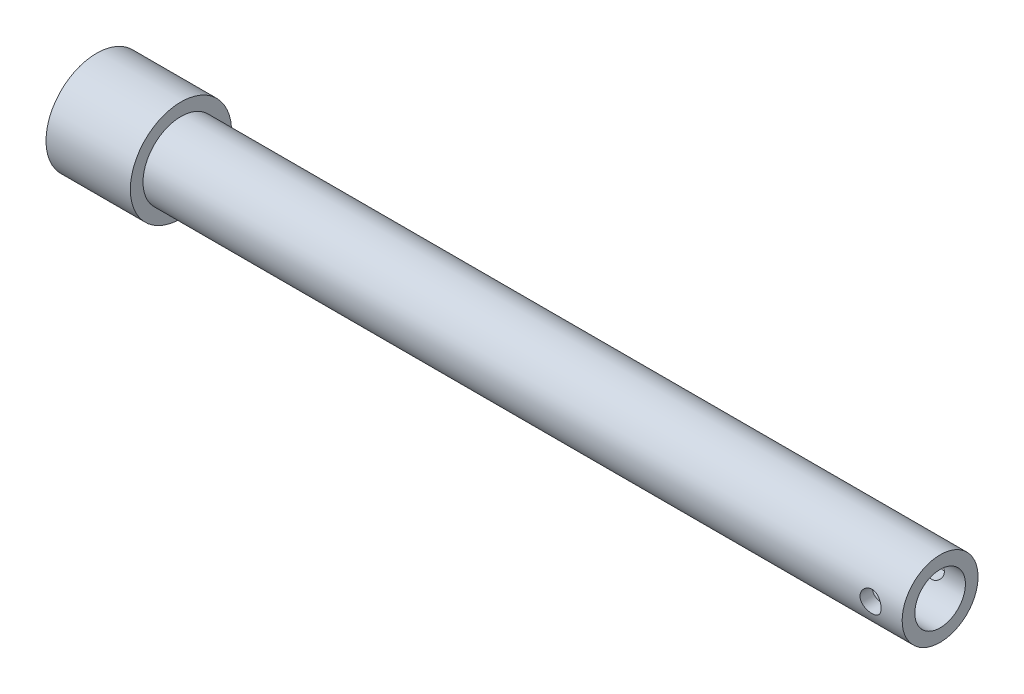
ISO-10303-21;
HEADER;
FILE_DESCRIPTION(('STEP AP214'),'2;1');
FILE_NAME('part.step','',(''),(''),'','','');
FILE_SCHEMA(('AUTOMOTIVE_DESIGN { 1 0 10303 214 1 1 1 1 }'));
ENDSEC;
DATA;
#1=APPLICATION_CONTEXT('core data for automotive mechanical design processes');
#2=APPLICATION_PROTOCOL_DEFINITION('international standard','automotive_design',2000,#1);
#3=PRODUCT_CONTEXT('',#1,'mechanical');
#4=PRODUCT('Part','Part','',(#3));
#5=PRODUCT_RELATED_PRODUCT_CATEGORY('part','',(#4));
#6=PRODUCT_DEFINITION_FORMATION('','',#4);
#7=PRODUCT_DEFINITION_CONTEXT('part definition',#1,'design');
#8=PRODUCT_DEFINITION('design','',#6,#7);
#9=PRODUCT_DEFINITION_SHAPE('','',#8);
#10=(LENGTH_UNIT() NAMED_UNIT(*) SI_UNIT(.MILLI.,.METRE.));
#11=(NAMED_UNIT(*) PLANE_ANGLE_UNIT() SI_UNIT($,.RADIAN.));
#12=(NAMED_UNIT(*) SI_UNIT($,.STERADIAN.) SOLID_ANGLE_UNIT());
#13=UNCERTAINTY_MEASURE_WITH_UNIT(LENGTH_MEASURE(1.E-05),#10,'distance_accuracy_value','');
#14=(GEOMETRIC_REPRESENTATION_CONTEXT(3) GLOBAL_UNCERTAINTY_ASSIGNED_CONTEXT((#13)) GLOBAL_UNIT_ASSIGNED_CONTEXT((#10,
#11,#12)) REPRESENTATION_CONTEXT('',''));
#15=CARTESIAN_POINT('',(0.,0.,0.));
#16=DIRECTION('',(0.,0.,1.));
#17=DIRECTION('',(1.,0.,0.));
#18=AXIS2_PLACEMENT_3D('',#15,#16,#17);
#19=CARTESIAN_POINT('',(0.,0.,0.));
#20=DIRECTION('',(-1.,0.,0.));
#21=DIRECTION('',(0.,0.,1.));
#22=AXIS2_PLACEMENT_3D('',#19,#20,#21);
#23=PLANE('',#22);
#24=CARTESIAN_POINT('',(0.,0.,0.));
#25=DIRECTION('',(-1.,0.,0.));
#26=DIRECTION('',(0.,0.,1.));
#27=AXIS2_PLACEMENT_3D('',#24,#25,#26);
#28=CIRCLE('',#27,12.);
#29=CARTESIAN_POINT('',(0.,0.,12.));
#30=VERTEX_POINT('',#29);
#31=EDGE_CURVE('E10',#30,#30,#28,.T.);
#32=ORIENTED_EDGE('',*,*,#31,.T.);
#33=EDGE_LOOP('',(#32));
#34=FACE_BOUND('',#33,.T.);
#35=ADVANCED_FACE('F35',(#34),#23,.T.);
#36=CARTESIAN_POINT('',(0.,0.,0.));
#37=DIRECTION('',(-1.,0.,0.));
#38=DIRECTION('',(0.,0.,1.));
#39=AXIS2_PLACEMENT_3D('',#36,#37,#38);
#40=CYLINDRICAL_SURFACE('',#39,12.);
#41=CARTESIAN_POINT('',(20.,0.,0.));
#42=DIRECTION('',(-1.,0.,0.));
#43=DIRECTION('',(0.,0.,1.));
#44=AXIS2_PLACEMENT_3D('',#41,#42,#43);
#45=CIRCLE('',#44,12.);
#46=CARTESIAN_POINT('',(20.,0.,12.));
#47=VERTEX_POINT('',#46);
#48=EDGE_CURVE('E47',#47,#47,#45,.T.);
#49=ORIENTED_EDGE('',*,*,#48,.T.);
#50=EDGE_LOOP('',(#49));
#51=FACE_BOUND('',#50,.T.);
#52=ORIENTED_EDGE('',*,*,#31,.F.);
#53=EDGE_LOOP('',(#52));
#54=FACE_BOUND('',#53,.T.);
#55=ADVANCED_FACE('F95',(#51,#54),#40,.T.);
#56=CARTESIAN_POINT('',(20.,-9.,0.));
#57=DIRECTION('',(1.,0.,0.));
#58=DIRECTION('',(0.,0.,-1.));
#59=AXIS2_PLACEMENT_3D('',#56,#57,#58);
#60=PLANE('',#59);
#61=CARTESIAN_POINT('',(20.,0.,0.));
#62=DIRECTION('',(-1.,0.,0.));
#63=DIRECTION('',(0.,0.,1.));
#64=AXIS2_PLACEMENT_3D('',#61,#62,#63);
#65=CIRCLE('',#64,9.);
#66=CARTESIAN_POINT('',(20.,0.,9.));
#67=VERTEX_POINT('',#66);
#68=EDGE_CURVE('E52',#67,#67,#65,.T.);
#69=ORIENTED_EDGE('',*,*,#68,.T.);
#70=EDGE_LOOP('',(#69));
#71=FACE_BOUND('',#70,.T.);
#72=ORIENTED_EDGE('',*,*,#48,.F.);
#73=EDGE_LOOP('',(#72));
#74=FACE_BOUND('',#73,.T.);
#75=ADVANCED_FACE('F91',(#71,#74),#60,.T.);
#76=CARTESIAN_POINT('',(0.,0.,0.));
#77=DIRECTION('',(-1.,0.,0.));
#78=DIRECTION('',(0.,0.,1.));
#79=AXIS2_PLACEMENT_3D('',#76,#77,#78);
#80=CYLINDRICAL_SURFACE('',#79,9.);
#81=CARTESIAN_POINT('',(195.,0.,9.));
#82=CARTESIAN_POINT('',(194.99999720083,0.137602501766361,8.99999816033858));
#83=CARTESIAN_POINT('',(194.988601360389,0.275234247505339,8.99681348173661));
#84=CARTESIAN_POINT('',(194.943408543469,0.546518951988484,8.98441900396477));
#85=CARTESIAN_POINT('',(194.909602116573,0.680170207326886,8.97520666298524));
#86=CARTESIAN_POINT('',(194.820782561172,0.93953989936061,8.95177130789171));
#87=CARTESIAN_POINT('',(194.765798062603,1.06526878019134,8.9375550606186));
#88=CARTESIAN_POINT('',(194.636292987346,1.30572139048356,8.90560625164058));
#89=CARTESIAN_POINT('',(194.561770676161,1.42044414162462,8.88787337777625));
#90=CARTESIAN_POINT('',(194.393341132314,1.63849356943186,8.85030315634724));
#91=CARTESIAN_POINT('',(194.299035920625,1.74150622561692,8.8304274724643));
#92=CARTESIAN_POINT('',(194.094567445757,1.93047637139274,8.79105214235472));
#93=CARTESIAN_POINT('',(193.984401955448,2.01643146169126,8.77155254937624));
#94=CARTESIAN_POINT('',(193.748785479743,2.17041617160632,8.73474088585436));
#95=CARTESIAN_POINT('',(193.623085583117,2.23807749895615,8.71747695878199));
#96=CARTESIAN_POINT('',(193.361536164715,2.35117914262343,8.68765801630373));
#97=CARTESIAN_POINT('',(193.225688699167,2.39662394672716,8.67510204999899));
#98=CARTESIAN_POINT('',(192.951194422294,2.46289848736027,8.65651766235507));
#99=CARTESIAN_POINT('',(192.812696356753,2.48430073808208,8.6503377182121));
#100=CARTESIAN_POINT('',(192.533948228915,2.50366854155518,8.644752985852));
#101=CARTESIAN_POINT('',(192.393698530255,2.50163888054629,8.64534681401298));
#102=CARTESIAN_POINT('',(192.119955442552,2.47465342675363,8.65310733650122));
#103=CARTESIAN_POINT('',(191.986386397007,2.45039804541377,8.66007321349827));
#104=CARTESIAN_POINT('',(191.725292742818,2.38077462403781,8.67947034094292));
#105=CARTESIAN_POINT('',(191.597768654796,2.33540476914309,8.69190206119269));
#106=CARTESIAN_POINT('',(191.350595537089,2.22428746268941,8.72100139554956));
#107=CARTESIAN_POINT('',(191.23106026638,2.15830043673987,8.7377183720132));
#108=CARTESIAN_POINT('',(191.004516848818,2.0079888135927,8.77347901367673));
#109=CARTESIAN_POINT('',(190.897511362548,1.92366033258121,8.79252317128379));
#110=CARTESIAN_POINT('',(190.695072239127,1.73551122056889,8.83162144253916));
#111=CARTESIAN_POINT('',(190.60018473024,1.63110455940471,8.85168740075652));
#112=CARTESIAN_POINT('',(190.429148538444,1.40761321440207,8.88996399621587));
#113=CARTESIAN_POINT('',(190.353000723795,1.28852785084393,8.90817454746904));
#114=CARTESIAN_POINT('',(190.22133636874,1.03816685867624,8.9408167942553));
#115=CARTESIAN_POINT('',(190.165925792122,0.906832791495497,8.95522897291068));
#116=CARTESIAN_POINT('',(190.078131803117,0.636219977539428,8.97850985002888));
#117=CARTESIAN_POINT('',(190.045742915687,0.49694312824226,8.98737986647399));
#118=CARTESIAN_POINT('',(190.005785726442,0.219053215426282,8.99837472966817));
#119=CARTESIAN_POINT('',(189.997475710186,0.080554611717358,9.00070107648057));
#120=CARTESIAN_POINT('',(190.003853996585,-0.195859861273143,8.99892960586323));
#121=CARTESIAN_POINT('',(190.018539703296,-0.333775794569047,8.9948325135635));
#122=CARTESIAN_POINT('',(190.069886668239,-0.602413826941726,8.98080530118043));
#123=CARTESIAN_POINT('',(190.106127890115,-0.733222576327732,8.97098674335107));
#124=CARTESIAN_POINT('',(190.199063735276,-0.986886236237465,8.94663658338763));
#125=CARTESIAN_POINT('',(190.255760665139,-1.10974024794482,8.93210444977129));
#126=CARTESIAN_POINT('',(190.389331756093,-1.34684028081079,8.89947480568143));
#127=CARTESIAN_POINT('',(190.466601048645,-1.46085412390692,8.88130942680351));
#128=CARTESIAN_POINT('',(190.638632271615,-1.6745553411742,8.84350954257204));
#129=CARTESIAN_POINT('',(190.733397960133,-1.77423962926345,8.82387472213289));
#130=CARTESIAN_POINT('',(190.941202887755,-1.95962405388923,8.78459685365757));
#131=CARTESIAN_POINT('',(191.054714903108,-2.04479915770504,8.76497216404559));
#132=CARTESIAN_POINT('',(191.294841275767,-2.19491162858283,8.72859386619893));
#133=CARTESIAN_POINT('',(191.421455131712,-2.25984976965916,8.71184014816765));
#134=CARTESIAN_POINT('',(191.683614339749,-2.36716211667705,8.68329597870045));
#135=CARTESIAN_POINT('',(191.819105275428,-2.40966154966514,8.67147806034821));
#136=CARTESIAN_POINT('',(192.095699418744,-2.47115304987675,8.65415753646738));
#137=CARTESIAN_POINT('',(192.236801029232,-2.49015175812554,8.64865314684266));
#138=CARTESIAN_POINT('',(192.515211559014,-2.50369719949212,8.64474076665062));
#139=CARTESIAN_POINT('',(192.652476380069,-2.49909142028601,8.64608680814104));
#140=CARTESIAN_POINT('',(192.924189787621,-2.46754286573622,8.65514273976249));
#141=CARTESIAN_POINT('',(193.058638458541,-2.44060076098733,8.66285243883987));
#142=CARTESIAN_POINT('',(193.319734467823,-2.3656544849756,8.68361437649822));
#143=CARTESIAN_POINT('',(193.446441685292,-2.31784429282324,8.69661733835621));
#144=CARTESIAN_POINT('',(193.690134845018,-2.20266903341382,8.72649832095034));
#145=CARTESIAN_POINT('',(193.807119142972,-2.13530066717354,8.74337699532341));
#146=CARTESIAN_POINT('',(194.032055305649,-1.98041392404221,8.77977621573303));
#147=CARTESIAN_POINT('',(194.139602953365,-1.89232416869261,8.79936357965206));
#148=CARTESIAN_POINT('',(194.338664744107,-1.69956305490126,8.83861663818042));
#149=CARTESIAN_POINT('',(194.430174905782,-1.59488759125637,8.85828235100436));
#150=CARTESIAN_POINT('',(194.596716273156,-1.36892046461579,8.89603679163285));
#151=CARTESIAN_POINT('',(194.671303246621,-1.24729251786436,8.91407682385634));
#152=CARTESIAN_POINT('',(194.798856278579,-0.992723965385682,8.94599949801159));
#153=CARTESIAN_POINT('',(194.851835037162,-0.859790060353452,8.95988458070659));
#154=CARTESIAN_POINT('',(194.928440161469,-0.606290967533404,8.98032149663911));
#155=CARTESIAN_POINT('',(194.955209575186,-0.486728804337484,8.98764491323713));
#156=CARTESIAN_POINT('',(194.990989691645,-0.244785251386819,8.99748469952567));
#157=CARTESIAN_POINT('',(195.00000249,-0.122404196038831,9.00000163646935));
#158=CARTESIAN_POINT('',(195.,0.,9.));
#159=B_SPLINE_CURVE_WITH_KNOTS('',3,(#81,#82,#83,#84,#85,#86,#87,#88,#89,#90,#91,#92,#93,#94,
#95,#96,#97,#98,#99,#100,#101,#102,#103,#104,#105,#106,#107,#108,#109,#110,#111,#112,#113,#114,
#115,#116,#117,#118,#119,#120,#121,#122,#123,#124,#125,#126,#127,#128,#129,#130,#131,#132,#133,
#134,#135,#136,#137,#138,#139,#140,#141,#142,#143,#144,#145,#146,#147,#148,#149,#150,#151,#152,
#153,#154,#155,#156,#157,#158),.UNSPECIFIED.,.T.,.F.,(4,2,2,2,2,2,2,2,2,2,2,2,2,2,2,2,2,2,2,2,2,
2,2,2,2,2,2,2,2,2,2,2,2,2,2,2,2,2,4),(0.,0.412358386198989,0.824890772294532,1.23686741588571,
1.64888064567588,2.0701524865053,2.49148354087993,2.92075380647346,3.34993732266769,
3.76866863882698,4.18731442577049,4.59320465989603,4.99912978807066,5.40995920090073,
5.82087569194114,6.24638987685089,6.67192377325056,7.09960331280663,7.52718110708778,
7.94144021185618,8.3556525550572,8.76204634963737,9.16848598334843,9.58337897777218,
9.99836119210695,10.4261198341447,10.8538621134517,11.2791912971971,11.7044002604959,
12.1144519850641,12.5244913992551,12.9307978713246,13.3371729171667,13.7564382656795,
14.1758075510165,14.6051618118988,15.0342633576385,15.4011197307047,15.7679328052828),.UNSPECIFIED.);
#160=CARTESIAN_POINT('',(195.,0.,9.));
#161=VERTEX_POINT('',#160);
#162=EDGE_CURVE('E81',#161,#161,#159,.T.);
#163=ORIENTED_EDGE('',*,*,#162,.F.);
#164=EDGE_LOOP('',(#163));
#165=FACE_BOUND('',#164,.T.);
#166=CARTESIAN_POINT('',(195.,0.,-9.));
#167=CARTESIAN_POINT('',(194.99999720083,-0.137602501766361,-8.99999816033858));
#168=CARTESIAN_POINT('',(194.988601360389,-0.275234247505339,-8.99681348173661));
#169=CARTESIAN_POINT('',(194.943408543469,-0.546518951988484,-8.98441900396477));
#170=CARTESIAN_POINT('',(194.909602116573,-0.680170207326886,-8.97520666298524));
#171=CARTESIAN_POINT('',(194.820782561172,-0.93953989936061,-8.95177130789171));
#172=CARTESIAN_POINT('',(194.765798062603,-1.06526878019134,-8.9375550606186));
#173=CARTESIAN_POINT('',(194.636292987346,-1.30572139048356,-8.90560625164058));
#174=CARTESIAN_POINT('',(194.561770676161,-1.42044414162462,-8.88787337777625));
#175=CARTESIAN_POINT('',(194.393341132314,-1.63849356943186,-8.85030315634724));
#176=CARTESIAN_POINT('',(194.299035920625,-1.74150622561692,-8.8304274724643));
#177=CARTESIAN_POINT('',(194.094567445757,-1.93047637139274,-8.79105214235472));
#178=CARTESIAN_POINT('',(193.984401955448,-2.01643146169126,-8.77155254937624));
#179=CARTESIAN_POINT('',(193.748785479743,-2.17041617160632,-8.73474088585436));
#180=CARTESIAN_POINT('',(193.623085583117,-2.23807749895615,-8.71747695878199));
#181=CARTESIAN_POINT('',(193.361536164715,-2.35117914262343,-8.68765801630373));
#182=CARTESIAN_POINT('',(193.225688699167,-2.39662394672716,-8.67510204999899));
#183=CARTESIAN_POINT('',(192.951194422294,-2.46289848736027,-8.65651766235507));
#184=CARTESIAN_POINT('',(192.812696356753,-2.48430073808208,-8.6503377182121));
#185=CARTESIAN_POINT('',(192.533948228915,-2.50366854155518,-8.644752985852));
#186=CARTESIAN_POINT('',(192.393698530255,-2.50163888054629,-8.64534681401298));
#187=CARTESIAN_POINT('',(192.119955442552,-2.47465342675363,-8.65310733650122));
#188=CARTESIAN_POINT('',(191.986386397007,-2.45039804541377,-8.66007321349827));
#189=CARTESIAN_POINT('',(191.725292742818,-2.38077462403781,-8.67947034094292));
#190=CARTESIAN_POINT('',(191.597768654796,-2.33540476914309,-8.69190206119269));
#191=CARTESIAN_POINT('',(191.350595537089,-2.22428746268941,-8.72100139554956));
#192=CARTESIAN_POINT('',(191.23106026638,-2.15830043673987,-8.7377183720132));
#193=CARTESIAN_POINT('',(191.004516848818,-2.0079888135927,-8.77347901367673));
#194=CARTESIAN_POINT('',(190.897511362548,-1.92366033258121,-8.79252317128379));
#195=CARTESIAN_POINT('',(190.695072239127,-1.73551122056889,-8.83162144253916));
#196=CARTESIAN_POINT('',(190.60018473024,-1.63110455940471,-8.85168740075652));
#197=CARTESIAN_POINT('',(190.429148538444,-1.40761321440207,-8.88996399621587));
#198=CARTESIAN_POINT('',(190.353000723795,-1.28852785084393,-8.90817454746904));
#199=CARTESIAN_POINT('',(190.22133636874,-1.03816685867624,-8.9408167942553));
#200=CARTESIAN_POINT('',(190.165925792122,-0.906832791495497,-8.95522897291068));
#201=CARTESIAN_POINT('',(190.078131803117,-0.636219977539428,-8.97850985002888));
#202=CARTESIAN_POINT('',(190.045742915687,-0.49694312824226,-8.98737986647399));
#203=CARTESIAN_POINT('',(190.005785726442,-0.219053215426282,-8.99837472966817));
#204=CARTESIAN_POINT('',(189.997475710186,-0.080554611717358,-9.00070107648057));
#205=CARTESIAN_POINT('',(190.003853996585,0.195859861273143,-8.99892960586323));
#206=CARTESIAN_POINT('',(190.018539703296,0.333775794569047,-8.9948325135635));
#207=CARTESIAN_POINT('',(190.069886668239,0.602413826941726,-8.98080530118043));
#208=CARTESIAN_POINT('',(190.106127890115,0.733222576327732,-8.97098674335107));
#209=CARTESIAN_POINT('',(190.199063735276,0.986886236237465,-8.94663658338763));
#210=CARTESIAN_POINT('',(190.255760665139,1.10974024794482,-8.93210444977129));
#211=CARTESIAN_POINT('',(190.389331756093,1.34684028081079,-8.89947480568143));
#212=CARTESIAN_POINT('',(190.466601048645,1.46085412390692,-8.88130942680351));
#213=CARTESIAN_POINT('',(190.638632271615,1.6745553411742,-8.84350954257204));
#214=CARTESIAN_POINT('',(190.733397960133,1.77423962926345,-8.82387472213289));
#215=CARTESIAN_POINT('',(190.941202887755,1.95962405388923,-8.78459685365757));
#216=CARTESIAN_POINT('',(191.054714903108,2.04479915770504,-8.76497216404559));
#217=CARTESIAN_POINT('',(191.294841275767,2.19491162858283,-8.72859386619893));
#218=CARTESIAN_POINT('',(191.421455131712,2.25984976965916,-8.71184014816765));
#219=CARTESIAN_POINT('',(191.683614339749,2.36716211667705,-8.68329597870045));
#220=CARTESIAN_POINT('',(191.819105275428,2.40966154966514,-8.67147806034821));
#221=CARTESIAN_POINT('',(192.095699418744,2.47115304987675,-8.65415753646738));
#222=CARTESIAN_POINT('',(192.236801029232,2.49015175812554,-8.64865314684266));
#223=CARTESIAN_POINT('',(192.515211559014,2.50369719949212,-8.64474076665062));
#224=CARTESIAN_POINT('',(192.652476380069,2.49909142028601,-8.64608680814104));
#225=CARTESIAN_POINT('',(192.924189787621,2.46754286573622,-8.65514273976249));
#226=CARTESIAN_POINT('',(193.058638458541,2.44060076098733,-8.66285243883987));
#227=CARTESIAN_POINT('',(193.319734467823,2.3656544849756,-8.68361437649822));
#228=CARTESIAN_POINT('',(193.446441685292,2.31784429282324,-8.69661733835621));
#229=CARTESIAN_POINT('',(193.690134845018,2.20266903341382,-8.72649832095034));
#230=CARTESIAN_POINT('',(193.807119142972,2.13530066717354,-8.74337699532341));
#231=CARTESIAN_POINT('',(194.032055305649,1.98041392404221,-8.77977621573303));
#232=CARTESIAN_POINT('',(194.139602953365,1.89232416869261,-8.79936357965206));
#233=CARTESIAN_POINT('',(194.338664744107,1.69956305490126,-8.83861663818042));
#234=CARTESIAN_POINT('',(194.430174905782,1.59488759125637,-8.85828235100436));
#235=CARTESIAN_POINT('',(194.596716273156,1.36892046461579,-8.89603679163285));
#236=CARTESIAN_POINT('',(194.671303246621,1.24729251786436,-8.91407682385634));
#237=CARTESIAN_POINT('',(194.798856278579,0.992723965385682,-8.94599949801159));
#238=CARTESIAN_POINT('',(194.851835037162,0.859790060353452,-8.95988458070659));
#239=CARTESIAN_POINT('',(194.928440161469,0.606290967533404,-8.98032149663911));
#240=CARTESIAN_POINT('',(194.955209575186,0.486728804337484,-8.98764491323713));
#241=CARTESIAN_POINT('',(194.990989691645,0.244785251386819,-8.99748469952567));
#242=CARTESIAN_POINT('',(195.00000249,0.122404196038831,-9.00000163646935));
#243=CARTESIAN_POINT('',(195.,0.,-9.));
#244=B_SPLINE_CURVE_WITH_KNOTS('',3,(#166,#167,#168,#169,#170,#171,#172,#173,#174,#175,#176,
#177,#178,#179,#180,#181,#182,#183,#184,#185,#186,#187,#188,#189,#190,#191,#192,#193,#194,#195,
#196,#197,#198,#199,#200,#201,#202,#203,#204,#205,#206,#207,#208,#209,#210,#211,#212,#213,#214,
#215,#216,#217,#218,#219,#220,#221,#222,#223,#224,#225,#226,#227,#228,#229,#230,#231,#232,#233,
#234,#235,#236,#237,#238,#239,#240,#241,#242,#243),.UNSPECIFIED.,.T.,.F.,(4,2,2,2,2,2,2,2,2,2,2,
2,2,2,2,2,2,2,2,2,2,2,2,2,2,2,2,2,2,2,2,2,2,2,2,2,2,2,4),(0.,0.412358386198989,
0.824890772294532,1.23686741588571,1.64888064567588,2.0701524865053,2.49148354087993,
2.92075380647346,3.34993732266769,3.76866863882698,4.18731442577049,4.59320465989603,
4.99912978807066,5.40995920090073,5.82087569194114,6.24638987685089,6.67192377325056,
7.09960331280663,7.52718110708778,7.94144021185618,8.3556525550572,8.76204634963737,
9.16848598334843,9.58337897777218,9.99836119210695,10.4261198341447,10.8538621134517,
11.2791912971971,11.7044002604959,12.1144519850641,12.5244913992551,12.9307978713246,
13.3371729171667,13.7564382656795,14.1758075510165,14.6051618118988,15.0342633576385,
15.4011197307047,15.7679328052828),.UNSPECIFIED.);
#245=CARTESIAN_POINT('',(195.,0.,-9.));
#246=VERTEX_POINT('',#245);
#247=EDGE_CURVE('E75',#246,#246,#244,.T.);
#248=ORIENTED_EDGE('',*,*,#247,.F.);
#249=EDGE_LOOP('',(#248));
#250=FACE_BOUND('',#249,.T.);
#251=CARTESIAN_POINT('',(200.,0.,0.));
#252=DIRECTION('',(-1.,0.,0.));
#253=DIRECTION('',(0.,0.,1.));
#254=AXIS2_PLACEMENT_3D('',#251,#252,#253);
#255=CIRCLE('',#254,9.);
#256=CARTESIAN_POINT('',(200.,0.,9.));
#257=VERTEX_POINT('',#256);
#258=EDGE_CURVE('E198',#257,#257,#255,.T.);
#259=ORIENTED_EDGE('',*,*,#258,.T.);
#260=EDGE_LOOP('',(#259));
#261=FACE_BOUND('',#260,.T.);
#262=ORIENTED_EDGE('',*,*,#68,.F.);
#263=EDGE_LOOP('',(#262));
#264=FACE_BOUND('',#263,.T.);
#265=ADVANCED_FACE('F86',(#165,#250,#261,#264),#80,.T.);
#266=CARTESIAN_POINT('',(200.,-6.,0.));
#267=DIRECTION('',(1.,0.,0.));
#268=DIRECTION('',(0.,0.,-1.));
#269=AXIS2_PLACEMENT_3D('',#266,#267,#268);
#270=PLANE('',#269);
#271=CARTESIAN_POINT('',(200.,0.,0.));
#272=DIRECTION('',(-1.,0.,0.));
#273=DIRECTION('',(0.,0.,1.));
#274=AXIS2_PLACEMENT_3D('',#271,#272,#273);
#275=CIRCLE('',#274,6.);
#276=CARTESIAN_POINT('',(200.,0.,6.));
#277=VERTEX_POINT('',#276);
#278=EDGE_CURVE('E197',#277,#277,#275,.T.);
#279=ORIENTED_EDGE('',*,*,#278,.T.);
#280=EDGE_LOOP('',(#279));
#281=FACE_BOUND('',#280,.T.);
#282=ORIENTED_EDGE('',*,*,#258,.F.);
#283=EDGE_LOOP('',(#282));
#284=FACE_BOUND('',#283,.T.);
#285=ADVANCED_FACE('F90',(#281,#284),#270,.T.);
#286=CARTESIAN_POINT('',(0.,0.,0.));
#287=DIRECTION('',(-1.,0.,0.));
#288=DIRECTION('',(0.,0.,1.));
#289=AXIS2_PLACEMENT_3D('',#286,#287,#288);
#290=CYLINDRICAL_SURFACE('',#289,6.);
#291=CARTESIAN_POINT('',(195.,0.,6.));
#292=CARTESIAN_POINT('',(194.99999528786,-0.133903918163791,5.99999628290907));
#293=CARTESIAN_POINT('',(194.989178684399,-0.268039524991424,5.99546656821164));
#294=CARTESIAN_POINT('',(194.946319261906,-0.532498019991117,5.97780115788617));
#295=CARTESIAN_POINT('',(194.914221053219,-0.662810029808678,5.96464300599791));
#296=CARTESIAN_POINT('',(194.830178511941,-0.915376593299238,5.93112629106012));
#297=CARTESIAN_POINT('',(194.778301407677,-1.03765681434385,5.91079213642029));
#298=CARTESIAN_POINT('',(194.656454166978,-1.27165974779734,5.8649055925345));
#299=CARTESIAN_POINT('',(194.586489511025,-1.38338564416288,5.83935478441347));
#300=CARTESIAN_POINT('',(194.426742088192,-1.598896740046,5.78415660619863));
#301=CARTESIAN_POINT('',(194.336197396748,-1.70208251703045,5.75437507703432));
#302=CARTESIAN_POINT('',(194.1394713161,-1.89231966019713,5.69465427085227));
#303=CARTESIAN_POINT('',(194.033281746285,-1.97936253123993,5.66471491925557));
#304=CARTESIAN_POINT('',(193.801946448989,-2.13907474876485,5.60642043928223));
#305=CARTESIAN_POINT('',(193.676125104249,-2.21082616169412,5.57821573827598));
#306=CARTESIAN_POINT('',(193.412853483057,-2.33187881316102,5.52871144633222));
#307=CARTESIAN_POINT('',(193.275409240743,-2.38119161708801,5.507408299805));
#308=CARTESIAN_POINT('',(192.999692616738,-2.45349196589848,5.47557110795536));
#309=CARTESIAN_POINT('',(192.861779033289,-2.47763315746004,5.4645677530895));
#310=CARTESIAN_POINT('',(192.583453414554,-2.502504199448,5.45322652433632));
#311=CARTESIAN_POINT('',(192.44304279993,-2.50324696111172,5.45288276849132));
#312=CARTESIAN_POINT('',(192.175199879148,-2.48216900725157,5.46250239122984));
#313=CARTESIAN_POINT('',(192.047597806876,-2.46207362224016,5.47167765447588));
#314=CARTESIAN_POINT('',(191.797775817995,-2.40278382032144,5.49796965547248));
#315=CARTESIAN_POINT('',(191.675556937015,-2.36358574574515,5.51508791407033));
#316=CARTESIAN_POINT('',(191.436884594018,-2.26643917454982,5.55572369545607));
#317=CARTESIAN_POINT('',(191.320609158174,-2.20810943078431,5.57936963898297));
#318=CARTESIAN_POINT('',(191.099044532239,-2.0746248516117,5.63036662282146));
#319=CARTESIAN_POINT('',(190.993759698773,-1.99946338103923,5.65771912259551));
#320=CARTESIAN_POINT('',(190.787800082534,-1.82699193108755,5.71585953755966));
#321=CARTESIAN_POINT('',(190.688266865229,-1.72834696641503,5.74674242808947));
#322=CARTESIAN_POINT('',(190.506772994082,-1.51545918210308,5.80651346225056));
#323=CARTESIAN_POINT('',(190.424816456616,-1.40121271889694,5.83540113754019));
#324=CARTESIAN_POINT('',(190.279128352767,-1.15689589738676,5.88876567112946));
#325=CARTESIAN_POINT('',(190.215861109699,-1.02652116489537,5.91312533086667));
#326=CARTESIAN_POINT('',(190.112557720793,-0.755704805053668,5.95378962829607));
#327=CARTESIAN_POINT('',(190.072508736112,-0.615268789590071,5.970098716916));
#328=CARTESIAN_POINT('',(190.019168015747,-0.337856226692455,5.9919928237277));
#329=CARTESIAN_POINT('',(190.004344285112,-0.201222570557278,5.9981908209425));
#330=CARTESIAN_POINT('',(189.997307552772,0.0727093109921759,6.00112100737489));
#331=CARTESIAN_POINT('',(190.005088059496,0.210007334305267,5.99785591423878));
#332=CARTESIAN_POINT('',(190.041942169612,0.474196484682869,5.9826243531388));
#333=CARTESIAN_POINT('',(190.069939908194,0.601265933278775,5.97109774567979));
#334=CARTESIAN_POINT('',(190.144936389082,0.848765497942182,5.94097213544829));
#335=CARTESIAN_POINT('',(190.191937531901,0.969194773036717,5.92237223919408));
#336=CARTESIAN_POINT('',(190.305141951424,1.20421799973828,5.87916541290331));
#337=CARTESIAN_POINT('',(190.371896366292,1.31851447371068,5.85438982938561));
#338=CARTESIAN_POINT('',(190.522106755583,1.53469243246282,5.80147609158182));
#339=CARTESIAN_POINT('',(190.605569703059,1.63656870520375,5.77333653537473));
#340=CARTESIAN_POINT('',(190.793806466545,1.83266686054868,5.71424175790867));
#341=CARTESIAN_POINT('',(190.899677005972,1.92582139596024,5.68322903182028));
#342=CARTESIAN_POINT('',(191.126042551871,2.09333969221048,5.62368673536039));
#343=CARTESIAN_POINT('',(191.246540870345,2.16769918571028,5.59515772986987));
#344=CARTESIAN_POINT('',(191.501228350604,2.29631920417611,5.54362772487864));
#345=CARTESIAN_POINT('',(191.635588071024,2.35027836475452,5.52071125109802));
#346=CARTESIAN_POINT('',(191.912741187626,2.43434827902355,5.48416711318334));
#347=CARTESIAN_POINT('',(192.055527524989,2.46447869724419,5.47053179113072));
#348=CARTESIAN_POINT('',(192.333637398378,2.49808160700534,5.45526329073079));
#349=CARTESIAN_POINT('',(192.468689324512,2.50342760836087,5.45278701929112));
#350=CARTESIAN_POINT('',(192.737685722355,2.49231151038003,5.45787706027258));
#351=CARTESIAN_POINT('',(192.8716303609,2.47585275892882,5.46544183100006));
#352=CARTESIAN_POINT('',(193.128185494678,2.42316809595847,5.48899102586043));
#353=CARTESIAN_POINT('',(193.251033345978,2.38789807270205,5.50456709625452));
#354=CARTESIAN_POINT('',(193.489096043664,2.29952656276965,5.54206362465904));
#355=CARTESIAN_POINT('',(193.604308734336,2.2464200656009,5.56398586515028));
#356=CARTESIAN_POINT('',(193.831391788147,2.12020572373922,5.61333908853253));
#357=CARTESIAN_POINT('',(193.942644645948,2.04608723750139,5.64102204404078));
#358=CARTESIAN_POINT('',(194.151720293115,1.88136812596242,5.69807379131313));
#359=CARTESIAN_POINT('',(194.249538405032,1.79076178563718,5.72744316520043));
#360=CARTESIAN_POINT('',(194.436297305618,1.5878041689884,5.78712781593092));
#361=CARTESIAN_POINT('',(194.524072642828,1.47434977868816,5.81735619175009));
#362=CARTESIAN_POINT('',(194.679399130042,1.23319985958045,5.87320303099821));
#363=CARTESIAN_POINT('',(194.746941063997,1.10549787741692,5.89881939160172));
#364=CARTESIAN_POINT('',(194.858418870452,0.84146521342221,5.94218308378895));
#365=CARTESIAN_POINT('',(194.90272649429,0.705312056415883,5.96005349044659));
#366=CARTESIAN_POINT('',(194.96741568753,0.426816782070279,5.9864223497589));
#367=CARTESIAN_POINT('',(194.987872168206,0.284495506121995,5.99495014042422));
#368=CARTESIAN_POINT('',(194.997323841786,0.118052512349441,5.99888566614292));
#369=CARTESIAN_POINT('',(194.998326602503,0.0944569348794064,5.99930292614998));
#370=CARTESIAN_POINT('',(194.999665098257,0.0472433090693387,5.99986042138656));
#371=CARTESIAN_POINT('',(195.000000831384,0.0236252606651517,6.0000006558228));
#372=CARTESIAN_POINT('',(195.,0.,6.));
#373=B_SPLINE_CURVE_WITH_KNOTS('',3,(#291,#292,#293,#294,#295,#296,#297,#298,#299,#300,#301,
#302,#303,#304,#305,#306,#307,#308,#309,#310,#311,#312,#313,#314,#315,#316,#317,#318,#319,#320,
#321,#322,#323,#324,#325,#326,#327,#328,#329,#330,#331,#332,#333,#334,#335,#336,#337,#338,#339,
#340,#341,#342,#343,#344,#345,#346,#347,#348,#349,#350,#351,#352,#353,#354,#355,#356,#357,#358,
#359,#360,#361,#362,#363,#364,#365,#366,#367,#368,#369,#370,#371,#372),.UNSPECIFIED.,.T.,.F.,(4,
2,2,2,2,2,2,2,2,2,2,2,2,2,2,2,2,2,2,2,2,2,2,2,2,2,2,2,2,2,2,2,2,2,2,2,2,2,2,2,4),(0.,
0.40161383776788,0.804277081257399,1.20558370381263,1.60676887370596,2.02635872577619,
2.44616876262935,2.8866344907825,3.32687293461179,3.74590546275119,4.16470676498097,
4.55140314405117,4.93817359454431,5.33317426117434,5.7283309143442,6.15688282255799,
6.58553498629183,7.02408110121635,7.46238448436603,7.87296886786511,8.28343534986352,
8.67353179471452,9.06367753203579,9.4659427054433,9.86837610939002,10.299569760586,
10.7308612248069,11.1682957671906,11.6053689414917,12.008797551193,12.4121642259509,
12.7967529992954,13.1814498990124,13.589277867949,13.997247468519,14.4349307000979,
14.8728129885718,15.3034571163879,15.7327450093866,15.8036033125923,15.8744618187071),.UNSPECIFIED.);
#374=CARTESIAN_POINT('',(195.,0.,6.));
#375=VERTEX_POINT('',#374);
#376=EDGE_CURVE('E38',#375,#375,#373,.T.);
#377=ORIENTED_EDGE('',*,*,#376,.F.);
#378=EDGE_LOOP('',(#377));
#379=FACE_BOUND('',#378,.T.);
#380=CARTESIAN_POINT('',(195.,0.,-6.));
#381=CARTESIAN_POINT('',(194.99999528786,0.133903918163791,-5.99999628290907));
#382=CARTESIAN_POINT('',(194.989178684399,0.268039524991424,-5.99546656821164));
#383=CARTESIAN_POINT('',(194.946319261906,0.532498019991117,-5.97780115788617));
#384=CARTESIAN_POINT('',(194.914221053219,0.662810029808678,-5.96464300599791));
#385=CARTESIAN_POINT('',(194.830178511941,0.915376593299238,-5.93112629106012));
#386=CARTESIAN_POINT('',(194.778301407677,1.03765681434385,-5.91079213642029));
#387=CARTESIAN_POINT('',(194.656454166978,1.27165974779734,-5.8649055925345));
#388=CARTESIAN_POINT('',(194.586489511025,1.38338564416288,-5.83935478441347));
#389=CARTESIAN_POINT('',(194.426742088192,1.598896740046,-5.78415660619863));
#390=CARTESIAN_POINT('',(194.336197396748,1.70208251703045,-5.75437507703432));
#391=CARTESIAN_POINT('',(194.1394713161,1.89231966019713,-5.69465427085227));
#392=CARTESIAN_POINT('',(194.033281746285,1.97936253123993,-5.66471491925557));
#393=CARTESIAN_POINT('',(193.801946448989,2.13907474876485,-5.60642043928223));
#394=CARTESIAN_POINT('',(193.676125104249,2.21082616169412,-5.57821573827598));
#395=CARTESIAN_POINT('',(193.412853483057,2.33187881316102,-5.52871144633222));
#396=CARTESIAN_POINT('',(193.275409240743,2.38119161708801,-5.507408299805));
#397=CARTESIAN_POINT('',(192.999692616738,2.45349196589848,-5.47557110795536));
#398=CARTESIAN_POINT('',(192.861779033289,2.47763315746004,-5.4645677530895));
#399=CARTESIAN_POINT('',(192.583453414554,2.502504199448,-5.45322652433632));
#400=CARTESIAN_POINT('',(192.44304279993,2.50324696111172,-5.45288276849132));
#401=CARTESIAN_POINT('',(192.175199879148,2.48216900725157,-5.46250239122984));
#402=CARTESIAN_POINT('',(192.047597806876,2.46207362224016,-5.47167765447588));
#403=CARTESIAN_POINT('',(191.797775817995,2.40278382032144,-5.49796965547248));
#404=CARTESIAN_POINT('',(191.675556937015,2.36358574574515,-5.51508791407033));
#405=CARTESIAN_POINT('',(191.436884594018,2.26643917454982,-5.55572369545607));
#406=CARTESIAN_POINT('',(191.320609158174,2.20810943078431,-5.57936963898297));
#407=CARTESIAN_POINT('',(191.099044532239,2.0746248516117,-5.63036662282146));
#408=CARTESIAN_POINT('',(190.993759698773,1.99946338103923,-5.65771912259551));
#409=CARTESIAN_POINT('',(190.787800082534,1.82699193108755,-5.71585953755966));
#410=CARTESIAN_POINT('',(190.688266865229,1.72834696641503,-5.74674242808947));
#411=CARTESIAN_POINT('',(190.506772994082,1.51545918210308,-5.80651346225056));
#412=CARTESIAN_POINT('',(190.424816456616,1.40121271889694,-5.83540113754019));
#413=CARTESIAN_POINT('',(190.279128352767,1.15689589738676,-5.88876567112946));
#414=CARTESIAN_POINT('',(190.215861109699,1.02652116489537,-5.91312533086667));
#415=CARTESIAN_POINT('',(190.112557720793,0.755704805053668,-5.95378962829607));
#416=CARTESIAN_POINT('',(190.072508736112,0.615268789590071,-5.970098716916));
#417=CARTESIAN_POINT('',(190.019168015747,0.337856226692455,-5.9919928237277));
#418=CARTESIAN_POINT('',(190.004344285112,0.201222570557278,-5.9981908209425));
#419=CARTESIAN_POINT('',(189.997307552772,-0.0727093109921759,-6.00112100737489));
#420=CARTESIAN_POINT('',(190.005088059496,-0.210007334305267,-5.99785591423878));
#421=CARTESIAN_POINT('',(190.041942169612,-0.474196484682869,-5.9826243531388));
#422=CARTESIAN_POINT('',(190.069939908194,-0.601265933278775,-5.97109774567979));
#423=CARTESIAN_POINT('',(190.144936389082,-0.848765497942182,-5.94097213544829));
#424=CARTESIAN_POINT('',(190.191937531901,-0.969194773036717,-5.92237223919408));
#425=CARTESIAN_POINT('',(190.305141951424,-1.20421799973828,-5.87916541290331));
#426=CARTESIAN_POINT('',(190.371896366292,-1.31851447371068,-5.85438982938561));
#427=CARTESIAN_POINT('',(190.522106755583,-1.53469243246282,-5.80147609158182));
#428=CARTESIAN_POINT('',(190.605569703059,-1.63656870520375,-5.77333653537473));
#429=CARTESIAN_POINT('',(190.793806466545,-1.83266686054868,-5.71424175790867));
#430=CARTESIAN_POINT('',(190.899677005972,-1.92582139596024,-5.68322903182028));
#431=CARTESIAN_POINT('',(191.126042551871,-2.09333969221048,-5.62368673536039));
#432=CARTESIAN_POINT('',(191.246540870345,-2.16769918571028,-5.59515772986987));
#433=CARTESIAN_POINT('',(191.501228350604,-2.29631920417611,-5.54362772487864));
#434=CARTESIAN_POINT('',(191.635588071024,-2.35027836475452,-5.52071125109802));
#435=CARTESIAN_POINT('',(191.912741187626,-2.43434827902355,-5.48416711318334));
#436=CARTESIAN_POINT('',(192.055527524989,-2.46447869724419,-5.47053179113072));
#437=CARTESIAN_POINT('',(192.333637398378,-2.49808160700534,-5.45526329073079));
#438=CARTESIAN_POINT('',(192.468689324512,-2.50342760836087,-5.45278701929112));
#439=CARTESIAN_POINT('',(192.737685722355,-2.49231151038003,-5.45787706027258));
#440=CARTESIAN_POINT('',(192.8716303609,-2.47585275892882,-5.46544183100006));
#441=CARTESIAN_POINT('',(193.128185494678,-2.42316809595847,-5.48899102586043));
#442=CARTESIAN_POINT('',(193.251033345978,-2.38789807270205,-5.50456709625452));
#443=CARTESIAN_POINT('',(193.489096043664,-2.29952656276965,-5.54206362465904));
#444=CARTESIAN_POINT('',(193.604308734336,-2.2464200656009,-5.56398586515028));
#445=CARTESIAN_POINT('',(193.831391788147,-2.12020572373922,-5.61333908853253));
#446=CARTESIAN_POINT('',(193.942644645948,-2.04608723750139,-5.64102204404078));
#447=CARTESIAN_POINT('',(194.151720293115,-1.88136812596242,-5.69807379131313));
#448=CARTESIAN_POINT('',(194.249538405032,-1.79076178563718,-5.72744316520043));
#449=CARTESIAN_POINT('',(194.436297305618,-1.5878041689884,-5.78712781593092));
#450=CARTESIAN_POINT('',(194.524072642828,-1.47434977868816,-5.81735619175009));
#451=CARTESIAN_POINT('',(194.679399130042,-1.23319985958045,-5.87320303099821));
#452=CARTESIAN_POINT('',(194.746941063997,-1.10549787741692,-5.89881939160172));
#453=CARTESIAN_POINT('',(194.858418870452,-0.84146521342221,-5.94218308378895));
#454=CARTESIAN_POINT('',(194.90272649429,-0.705312056415883,-5.96005349044659));
#455=CARTESIAN_POINT('',(194.96741568753,-0.426816782070279,-5.9864223497589));
#456=CARTESIAN_POINT('',(194.987872168206,-0.284495506121995,-5.99495014042422));
#457=CARTESIAN_POINT('',(194.997323841786,-0.118052512349441,-5.99888566614292));
#458=CARTESIAN_POINT('',(194.998326602503,-0.0944569348794064,-5.99930292614998));
#459=CARTESIAN_POINT('',(194.999665098257,-0.0472433090693387,-5.99986042138656));
#460=CARTESIAN_POINT('',(195.000000831384,-0.0236252606651517,-6.0000006558228));
#461=CARTESIAN_POINT('',(195.,0.,-6.));
#462=B_SPLINE_CURVE_WITH_KNOTS('',3,(#380,#381,#382,#383,#384,#385,#386,#387,#388,#389,#390,
#391,#392,#393,#394,#395,#396,#397,#398,#399,#400,#401,#402,#403,#404,#405,#406,#407,#408,#409,
#410,#411,#412,#413,#414,#415,#416,#417,#418,#419,#420,#421,#422,#423,#424,#425,#426,#427,#428,
#429,#430,#431,#432,#433,#434,#435,#436,#437,#438,#439,#440,#441,#442,#443,#444,#445,#446,#447,
#448,#449,#450,#451,#452,#453,#454,#455,#456,#457,#458,#459,#460,#461),.UNSPECIFIED.,.T.,.F.,(4,
2,2,2,2,2,2,2,2,2,2,2,2,2,2,2,2,2,2,2,2,2,2,2,2,2,2,2,2,2,2,2,2,2,2,2,2,2,2,2,4),(0.,
0.40161383776788,0.804277081257399,1.20558370381263,1.60676887370596,2.02635872577619,
2.44616876262935,2.8866344907825,3.32687293461179,3.74590546275119,4.16470676498097,
4.55140314405117,4.93817359454431,5.33317426117434,5.7283309143442,6.15688282255799,
6.58553498629183,7.02408110121635,7.46238448436603,7.87296886786511,8.28343534986352,
8.67353179471452,9.06367753203579,9.4659427054433,9.86837610939002,10.299569760586,
10.7308612248069,11.1682957671906,11.6053689414917,12.008797551193,12.4121642259509,
12.7967529992954,13.1814498990124,13.589277867949,13.997247468519,14.4349307000979,
14.8728129885718,15.3034571163879,15.7327450093866,15.8036033125923,15.8744618187071),.UNSPECIFIED.);
#463=CARTESIAN_POINT('',(195.,0.,-6.));
#464=VERTEX_POINT('',#463);
#465=EDGE_CURVE('E55',#464,#464,#462,.T.);
#466=ORIENTED_EDGE('',*,*,#465,.F.);
#467=EDGE_LOOP('',(#466));
#468=FACE_BOUND('',#467,.T.);
#469=CARTESIAN_POINT('',(20.,0.,0.));
#470=DIRECTION('',(-1.,0.,0.));
#471=DIRECTION('',(0.,0.,1.));
#472=AXIS2_PLACEMENT_3D('',#469,#470,#471);
#473=CIRCLE('',#472,6.);
#474=CARTESIAN_POINT('',(20.,0.,6.));
#475=VERTEX_POINT('',#474);
#476=EDGE_CURVE('E194',#475,#475,#473,.T.);
#477=ORIENTED_EDGE('',*,*,#476,.T.);
#478=EDGE_LOOP('',(#477));
#479=FACE_BOUND('',#478,.T.);
#480=ORIENTED_EDGE('',*,*,#278,.F.);
#481=EDGE_LOOP('',(#480));
#482=FACE_BOUND('',#481,.T.);
#483=ADVANCED_FACE('F60',(#379,#468,#479,#482),#290,.F.);
#484=CARTESIAN_POINT('',(20.,0.,0.));
#485=DIRECTION('',(1.,0.,0.));
#486=DIRECTION('',(0.,0.,-1.));
#487=AXIS2_PLACEMENT_3D('',#484,#485,#486);
#488=PLANE('',#487);
#489=ORIENTED_EDGE('',*,*,#476,.F.);
#490=EDGE_LOOP('',(#489));
#491=FACE_BOUND('',#490,.T.);
#492=ADVANCED_FACE('F68',(#491),#488,.T.);
#493=CARTESIAN_POINT('',(192.5,0.,-12.));
#494=DIRECTION('',(0.,0.,1.));
#495=DIRECTION('',(1.,0.,0.));
#496=AXIS2_PLACEMENT_3D('',#493,#494,#495);
#497=CYLINDRICAL_SURFACE('',#496,2.50000000000002);
#498=ORIENTED_EDGE('',*,*,#247,.T.);
#499=EDGE_LOOP('',(#498));
#500=FACE_BOUND('',#499,.T.);
#501=ORIENTED_EDGE('',*,*,#465,.T.);
#502=EDGE_LOOP('',(#501));
#503=FACE_BOUND('',#502,.T.);
#504=ADVANCED_FACE('F64',(#500,#503),#497,.F.);
#505=ORIENTED_EDGE('',*,*,#162,.T.);
#506=EDGE_LOOP('',(#505));
#507=FACE_BOUND('',#506,.T.);
#508=ORIENTED_EDGE('',*,*,#376,.T.);
#509=EDGE_LOOP('',(#508));
#510=FACE_BOUND('',#509,.T.);
#511=ADVANCED_FACE('F67',(#507,#510),#497,.F.);
#512=CLOSED_SHELL('',(#35,#55,#75,#265,#285,#483,#492,#504,#511));
#513=MANIFOLD_SOLID_BREP('B2',#512);
#514=ADVANCED_BREP_SHAPE_REPRESENTATION('',(#18,#513),#14);
#515=SHAPE_DEFINITION_REPRESENTATION(#9,#514);
ENDSEC;
END-ISO-10303-21;
